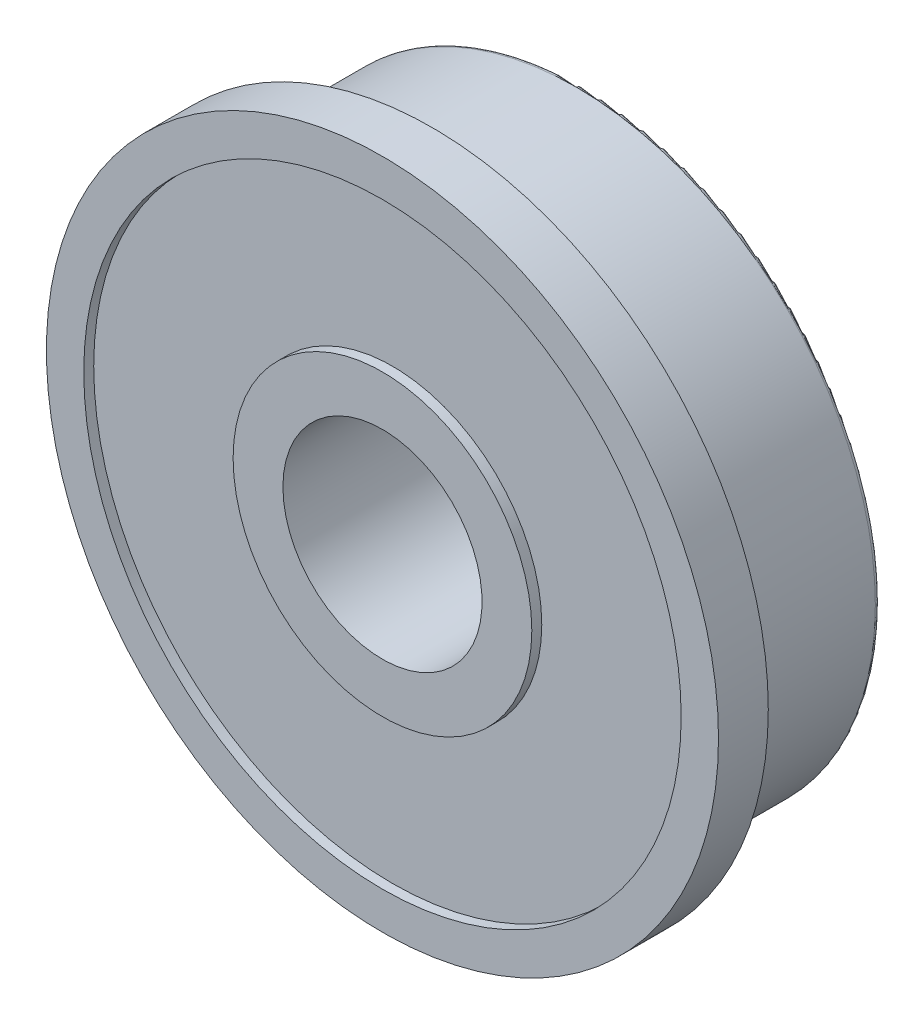
ISO-10303-21;
HEADER;
FILE_DESCRIPTION(('STEP AP214'),'2;1');
FILE_NAME('part.step','',(''),(''),'','','');
FILE_SCHEMA(('AUTOMOTIVE_DESIGN { 1 0 10303 214 1 1 1 1 }'));
ENDSEC;
DATA;
#1=APPLICATION_CONTEXT('core data for automotive mechanical design processes');
#2=APPLICATION_PROTOCOL_DEFINITION('international standard','automotive_design',2000,#1);
#3=PRODUCT_CONTEXT('',#1,'mechanical');
#4=PRODUCT('Part','Part','',(#3));
#5=PRODUCT_RELATED_PRODUCT_CATEGORY('part','',(#4));
#6=PRODUCT_DEFINITION_FORMATION('','',#4);
#7=PRODUCT_DEFINITION_CONTEXT('part definition',#1,'design');
#8=PRODUCT_DEFINITION('design','',#6,#7);
#9=PRODUCT_DEFINITION_SHAPE('','',#8);
#10=(LENGTH_UNIT() NAMED_UNIT(*) SI_UNIT(.MILLI.,.METRE.));
#11=(NAMED_UNIT(*) PLANE_ANGLE_UNIT() SI_UNIT($,.RADIAN.));
#12=(NAMED_UNIT(*) SI_UNIT($,.STERADIAN.) SOLID_ANGLE_UNIT());
#13=UNCERTAINTY_MEASURE_WITH_UNIT(LENGTH_MEASURE(1.E-05),#10,'distance_accuracy_value','');
#14=(GEOMETRIC_REPRESENTATION_CONTEXT(3) GLOBAL_UNCERTAINTY_ASSIGNED_CONTEXT((#13)) GLOBAL_UNIT_ASSIGNED_CONTEXT((#10,
#11,#12)) REPRESENTATION_CONTEXT('',''));
#15=CARTESIAN_POINT('',(0.,0.,0.));
#16=DIRECTION('',(0.,0.,1.));
#17=DIRECTION('',(1.,0.,0.));
#18=AXIS2_PLACEMENT_3D('',#15,#16,#17);
#19=CARTESIAN_POINT('',(0.,0.,4.));
#20=DIRECTION('',(0.,0.,1.));
#21=DIRECTION('',(1.,0.,0.));
#22=AXIS2_PLACEMENT_3D('',#19,#20,#21);
#23=PLANE('',#22);
#24=CARTESIAN_POINT('',(0.,0.,4.));
#25=DIRECTION('',(0.,0.,-1.));
#26=DIRECTION('',(-1.,0.,0.));
#27=AXIS2_PLACEMENT_3D('',#24,#25,#26);
#28=CIRCLE('',#27,2.);
#29=CARTESIAN_POINT('',(-2.,0.,4.));
#30=VERTEX_POINT('',#29);
#31=EDGE_CURVE('E57',#30,#30,#28,.T.);
#32=ORIENTED_EDGE('',*,*,#31,.T.);
#33=EDGE_LOOP('',(#32));
#34=FACE_BOUND('',#33,.T.);
#35=CARTESIAN_POINT('',(0.,0.,4.));
#36=DIRECTION('',(0.,0.,1.));
#37=DIRECTION('',(1.,0.,0.));
#38=AXIS2_PLACEMENT_3D('',#35,#36,#37);
#39=CIRCLE('',#38,3.);
#40=CARTESIAN_POINT('',(3.,0.,4.));
#41=VERTEX_POINT('',#40);
#42=EDGE_CURVE('E84',#41,#41,#39,.T.);
#43=ORIENTED_EDGE('',*,*,#42,.T.);
#44=EDGE_LOOP('',(#43));
#45=FACE_BOUND('',#44,.T.);
#46=ADVANCED_FACE('F36',(#34,#45),#23,.T.);
#47=CARTESIAN_POINT('',(0.,0.,0.));
#48=DIRECTION('',(0.,0.,1.));
#49=DIRECTION('',(1.,0.,0.));
#50=AXIS2_PLACEMENT_3D('',#47,#48,#49);
#51=PLANE('',#50);
#52=CARTESIAN_POINT('',(0.,0.,0.));
#53=DIRECTION('',(0.,0.,-1.));
#54=DIRECTION('',(-1.,0.,0.));
#55=AXIS2_PLACEMENT_3D('',#52,#53,#54);
#56=CIRCLE('',#55,2.);
#57=CARTESIAN_POINT('',(-2.,0.,0.));
#58=VERTEX_POINT('',#57);
#59=EDGE_CURVE('E60',#58,#58,#56,.T.);
#60=ORIENTED_EDGE('',*,*,#59,.F.);
#61=EDGE_LOOP('',(#60));
#62=FACE_BOUND('',#61,.T.);
#63=CARTESIAN_POINT('',(0.,0.,0.));
#64=DIRECTION('',(0.,0.,-1.));
#65=DIRECTION('',(-1.,0.,0.));
#66=AXIS2_PLACEMENT_3D('',#63,#64,#65);
#67=CIRCLE('',#66,3.);
#68=CARTESIAN_POINT('',(-3.,0.,0.));
#69=VERTEX_POINT('',#68);
#70=EDGE_CURVE('E72',#69,#69,#67,.T.);
#71=ORIENTED_EDGE('',*,*,#70,.T.);
#72=EDGE_LOOP('',(#71));
#73=FACE_BOUND('',#72,.T.);
#74=ADVANCED_FACE('F127',(#62,#73),#51,.F.);
#75=CARTESIAN_POINT('',(0.,0.,4.));
#76=DIRECTION('',(0.,0.,-1.));
#77=DIRECTION('',(-1.,0.,0.));
#78=AXIS2_PLACEMENT_3D('',#75,#76,#77);
#79=CYLINDRICAL_SURFACE('',#78,6.);
#80=CARTESIAN_POINT('',(0.,0.,0.0999999999999998));
#81=DIRECTION('',(0.,0.,1.));
#82=DIRECTION('',(1.,0.,0.));
#83=AXIS2_PLACEMENT_3D('',#80,#81,#82);
#84=CIRCLE('',#83,6.);
#85=CARTESIAN_POINT('',(6.,0.,0.0999999999999998));
#86=VERTEX_POINT('',#85);
#87=EDGE_CURVE('E43',#86,#86,#84,.T.);
#88=ORIENTED_EDGE('',*,*,#87,.T.);
#89=EDGE_LOOP('',(#88));
#90=FACE_BOUND('',#89,.T.);
#91=CARTESIAN_POINT('',(0.,0.,3.));
#92=DIRECTION('',(0.,0.,1.));
#93=DIRECTION('',(1.,0.,0.));
#94=AXIS2_PLACEMENT_3D('',#91,#92,#93);
#95=CIRCLE('',#94,6.);
#96=CARTESIAN_POINT('',(6.,0.,3.));
#97=VERTEX_POINT('',#96);
#98=EDGE_CURVE('E47',#97,#97,#95,.T.);
#99=ORIENTED_EDGE('',*,*,#98,.F.);
#100=EDGE_LOOP('',(#99));
#101=FACE_BOUND('',#100,.T.);
#102=ADVANCED_FACE('F125',(#90,#101),#79,.T.);
#103=CARTESIAN_POINT('',(0.,0.,0.));
#104=DIRECTION('',(0.,0.,1.));
#105=DIRECTION('',(1.,0.,0.));
#106=AXIS2_PLACEMENT_3D('',#103,#104,#105);
#107=CIRCLE('',#106,5.9);
#108=CARTESIAN_POINT('',(5.9,0.,0.));
#109=VERTEX_POINT('',#108);
#110=EDGE_CURVE('E10',#109,#109,#107,.F.);
#111=ORIENTED_EDGE('',*,*,#110,.T.);
#112=EDGE_LOOP('',(#111));
#113=FACE_BOUND('',#112,.T.);
#114=CARTESIAN_POINT('',(0.,0.,0.));
#115=DIRECTION('',(0.,0.,-1.));
#116=DIRECTION('',(-1.,0.,0.));
#117=AXIS2_PLACEMENT_3D('',#114,#115,#116);
#118=CIRCLE('',#117,5.);
#119=CARTESIAN_POINT('',(-5.,0.,0.));
#120=VERTEX_POINT('',#119);
#121=EDGE_CURVE('E66',#120,#120,#118,.T.);
#122=ORIENTED_EDGE('',*,*,#121,.F.);
#123=EDGE_LOOP('',(#122));
#124=FACE_BOUND('',#123,.T.);
#125=ADVANCED_FACE('F116',(#113,#124),#51,.F.);
#126=CARTESIAN_POINT('',(0.,0.,3.));
#127=DIRECTION('',(0.,0.,1.));
#128=DIRECTION('',(1.,0.,0.));
#129=AXIS2_PLACEMENT_3D('',#126,#127,#128);
#130=CYLINDRICAL_SURFACE('',#129,6.75);
#131=CARTESIAN_POINT('',(0.,0.,3.));
#132=DIRECTION('',(0.,0.,1.));
#133=DIRECTION('',(1.,0.,0.));
#134=AXIS2_PLACEMENT_3D('',#131,#132,#133);
#135=CIRCLE('',#134,6.75);
#136=CARTESIAN_POINT('',(6.75,0.,3.));
#137=VERTEX_POINT('',#136);
#138=EDGE_CURVE('E51',#137,#137,#135,.T.);
#139=ORIENTED_EDGE('',*,*,#138,.T.);
#140=EDGE_LOOP('',(#139));
#141=FACE_BOUND('',#140,.T.);
#142=CARTESIAN_POINT('',(0.,0.,4.));
#143=DIRECTION('',(0.,0.,1.));
#144=DIRECTION('',(1.,0.,0.));
#145=AXIS2_PLACEMENT_3D('',#142,#143,#144);
#146=CIRCLE('',#145,6.75);
#147=CARTESIAN_POINT('',(6.75,0.,4.));
#148=VERTEX_POINT('',#147);
#149=EDGE_CURVE('E54',#148,#148,#146,.T.);
#150=ORIENTED_EDGE('',*,*,#149,.F.);
#151=EDGE_LOOP('',(#150));
#152=FACE_BOUND('',#151,.T.);
#153=ADVANCED_FACE('F114',(#141,#152),#130,.T.);
#154=CARTESIAN_POINT('',(0.,0.,3.));
#155=DIRECTION('',(0.,0.,1.));
#156=DIRECTION('',(1.,0.,0.));
#157=AXIS2_PLACEMENT_3D('',#154,#155,#156);
#158=PLANE('',#157);
#159=ORIENTED_EDGE('',*,*,#98,.T.);
#160=EDGE_LOOP('',(#159));
#161=FACE_BOUND('',#160,.T.);
#162=ORIENTED_EDGE('',*,*,#138,.F.);
#163=EDGE_LOOP('',(#162));
#164=FACE_BOUND('',#163,.T.);
#165=ADVANCED_FACE('F110',(#161,#164),#158,.F.);
#166=CARTESIAN_POINT('',(0.,0.,4.));
#167=DIRECTION('',(0.,0.,1.));
#168=DIRECTION('',(1.,0.,0.));
#169=AXIS2_PLACEMENT_3D('',#166,#167,#168);
#170=CIRCLE('',#169,6.);
#171=CARTESIAN_POINT('',(6.,0.,4.));
#172=VERTEX_POINT('',#171);
#173=EDGE_CURVE('E78',#172,#172,#170,.T.);
#174=ORIENTED_EDGE('',*,*,#173,.F.);
#175=EDGE_LOOP('',(#174));
#176=FACE_BOUND('',#175,.T.);
#177=ORIENTED_EDGE('',*,*,#149,.T.);
#178=EDGE_LOOP('',(#177));
#179=FACE_BOUND('',#178,.T.);
#180=ADVANCED_FACE('F106',(#176,#179),#23,.T.);
#181=CARTESIAN_POINT('',(0.,0.,4.));
#182=DIRECTION('',(0.,0.,-1.));
#183=DIRECTION('',(-1.,0.,0.));
#184=AXIS2_PLACEMENT_3D('',#181,#182,#183);
#185=CYLINDRICAL_SURFACE('',#184,2.);
#186=ORIENTED_EDGE('',*,*,#31,.F.);
#187=EDGE_LOOP('',(#186));
#188=FACE_BOUND('',#187,.T.);
#189=ORIENTED_EDGE('',*,*,#59,.T.);
#190=EDGE_LOOP('',(#189));
#191=FACE_BOUND('',#190,.T.);
#192=ADVANCED_FACE('F109',(#188,#191),#185,.F.);
#193=CARTESIAN_POINT('',(0.,0.,0.2));
#194=DIRECTION('',(0.,0.,-1.));
#195=DIRECTION('',(-1.,0.,0.));
#196=AXIS2_PLACEMENT_3D('',#193,#194,#195);
#197=CYLINDRICAL_SURFACE('',#196,5.);
#198=CARTESIAN_POINT('',(0.,0.,0.2));
#199=DIRECTION('',(0.,0.,-1.));
#200=DIRECTION('',(-1.,0.,0.));
#201=AXIS2_PLACEMENT_3D('',#198,#199,#200);
#202=CIRCLE('',#201,5.);
#203=CARTESIAN_POINT('',(-5.,0.,0.2));
#204=VERTEX_POINT('',#203);
#205=EDGE_CURVE('E63',#204,#204,#202,.T.);
#206=ORIENTED_EDGE('',*,*,#205,.F.);
#207=EDGE_LOOP('',(#206));
#208=FACE_BOUND('',#207,.T.);
#209=ORIENTED_EDGE('',*,*,#121,.T.);
#210=EDGE_LOOP('',(#209));
#211=FACE_BOUND('',#210,.T.);
#212=ADVANCED_FACE('F189',(#208,#211),#197,.F.);
#213=CARTESIAN_POINT('',(0.,0.,0.2));
#214=DIRECTION('',(0.,0.,-1.));
#215=DIRECTION('',(-1.,0.,0.));
#216=AXIS2_PLACEMENT_3D('',#213,#214,#215);
#217=PLANE('',#216);
#218=CARTESIAN_POINT('',(0.,0.,0.2));
#219=DIRECTION('',(0.,0.,-1.));
#220=DIRECTION('',(-1.,0.,0.));
#221=AXIS2_PLACEMENT_3D('',#218,#219,#220);
#222=CIRCLE('',#221,3.);
#223=CARTESIAN_POINT('',(-3.,0.,0.2));
#224=VERTEX_POINT('',#223);
#225=EDGE_CURVE('E69',#224,#224,#222,.T.);
#226=ORIENTED_EDGE('',*,*,#225,.F.);
#227=EDGE_LOOP('',(#226));
#228=FACE_BOUND('',#227,.T.);
#229=ORIENTED_EDGE('',*,*,#205,.T.);
#230=EDGE_LOOP('',(#229));
#231=FACE_BOUND('',#230,.T.);
#232=ADVANCED_FACE('F181',(#228,#231),#217,.T.);
#233=CARTESIAN_POINT('',(0.,0.,0.2));
#234=DIRECTION('',(0.,0.,-1.));
#235=DIRECTION('',(-1.,0.,0.));
#236=AXIS2_PLACEMENT_3D('',#233,#234,#235);
#237=CYLINDRICAL_SURFACE('',#236,3.);
#238=ORIENTED_EDGE('',*,*,#225,.T.);
#239=EDGE_LOOP('',(#238));
#240=FACE_BOUND('',#239,.T.);
#241=ORIENTED_EDGE('',*,*,#70,.F.);
#242=EDGE_LOOP('',(#241));
#243=FACE_BOUND('',#242,.T.);
#244=ADVANCED_FACE('F102',(#240,#243),#237,.T.);
#245=CARTESIAN_POINT('',(0.,0.,3.8));
#246=DIRECTION('',(0.,0.,1.));
#247=DIRECTION('',(1.,0.,0.));
#248=AXIS2_PLACEMENT_3D('',#245,#246,#247);
#249=CYLINDRICAL_SURFACE('',#248,6.);
#250=CARTESIAN_POINT('',(0.,0.,3.8));
#251=DIRECTION('',(0.,0.,1.));
#252=DIRECTION('',(1.,0.,0.));
#253=AXIS2_PLACEMENT_3D('',#250,#251,#252);
#254=CIRCLE('',#253,6.);
#255=CARTESIAN_POINT('',(6.,0.,3.8));
#256=VERTEX_POINT('',#255);
#257=EDGE_CURVE('E75',#256,#256,#254,.T.);
#258=ORIENTED_EDGE('',*,*,#257,.F.);
#259=EDGE_LOOP('',(#258));
#260=FACE_BOUND('',#259,.T.);
#261=ORIENTED_EDGE('',*,*,#173,.T.);
#262=EDGE_LOOP('',(#261));
#263=FACE_BOUND('',#262,.T.);
#264=ADVANCED_FACE('F96',(#260,#263),#249,.F.);
#265=CARTESIAN_POINT('',(0.,0.,3.8));
#266=DIRECTION('',(0.,0.,1.));
#267=DIRECTION('',(1.,0.,0.));
#268=AXIS2_PLACEMENT_3D('',#265,#266,#267);
#269=PLANE('',#268);
#270=CARTESIAN_POINT('',(0.,0.,3.8));
#271=DIRECTION('',(0.,0.,1.));
#272=DIRECTION('',(1.,0.,0.));
#273=AXIS2_PLACEMENT_3D('',#270,#271,#272);
#274=CIRCLE('',#273,3.);
#275=CARTESIAN_POINT('',(3.,0.,3.8));
#276=VERTEX_POINT('',#275);
#277=EDGE_CURVE('E81',#276,#276,#274,.T.);
#278=ORIENTED_EDGE('',*,*,#277,.F.);
#279=EDGE_LOOP('',(#278));
#280=FACE_BOUND('',#279,.T.);
#281=ORIENTED_EDGE('',*,*,#257,.T.);
#282=EDGE_LOOP('',(#281));
#283=FACE_BOUND('',#282,.T.);
#284=ADVANCED_FACE('F93',(#280,#283),#269,.T.);
#285=CARTESIAN_POINT('',(0.,0.,3.8));
#286=DIRECTION('',(0.,0.,1.));
#287=DIRECTION('',(1.,0.,0.));
#288=AXIS2_PLACEMENT_3D('',#285,#286,#287);
#289=CYLINDRICAL_SURFACE('',#288,3.);
#290=ORIENTED_EDGE('',*,*,#277,.T.);
#291=EDGE_LOOP('',(#290));
#292=FACE_BOUND('',#291,.T.);
#293=ORIENTED_EDGE('',*,*,#42,.F.);
#294=EDGE_LOOP('',(#293));
#295=FACE_BOUND('',#294,.T.);
#296=ADVANCED_FACE('F90',(#292,#295),#289,.T.);
#297=CARTESIAN_POINT('',(0.,0.,0.0999999999999998));
#298=DIRECTION('',(0.,0.,1.));
#299=DIRECTION('',(1.,0.,0.));
#300=AXIS2_PLACEMENT_3D('',#297,#298,#299);
#301=TOROIDAL_SURFACE('',#300,5.9,0.1);
#302=ORIENTED_EDGE('',*,*,#110,.F.);
#303=EDGE_LOOP('',(#302));
#304=FACE_BOUND('',#303,.T.);
#305=ORIENTED_EDGE('',*,*,#87,.F.);
#306=EDGE_LOOP('',(#305));
#307=FACE_BOUND('',#306,.T.);
#308=ADVANCED_FACE('F38',(#304,#307),#301,.T.);
#309=CLOSED_SHELL('',(#46,#74,#102,#125,#153,#165,#180,#192,#212,#232,#244,#264,#284,#296,#308));
#310=MANIFOLD_SOLID_BREP('B2',#309);
#311=ADVANCED_BREP_SHAPE_REPRESENTATION('',(#18,#310),#14);
#312=SHAPE_DEFINITION_REPRESENTATION(#9,#311);
ENDSEC;
END-ISO-10303-21;
